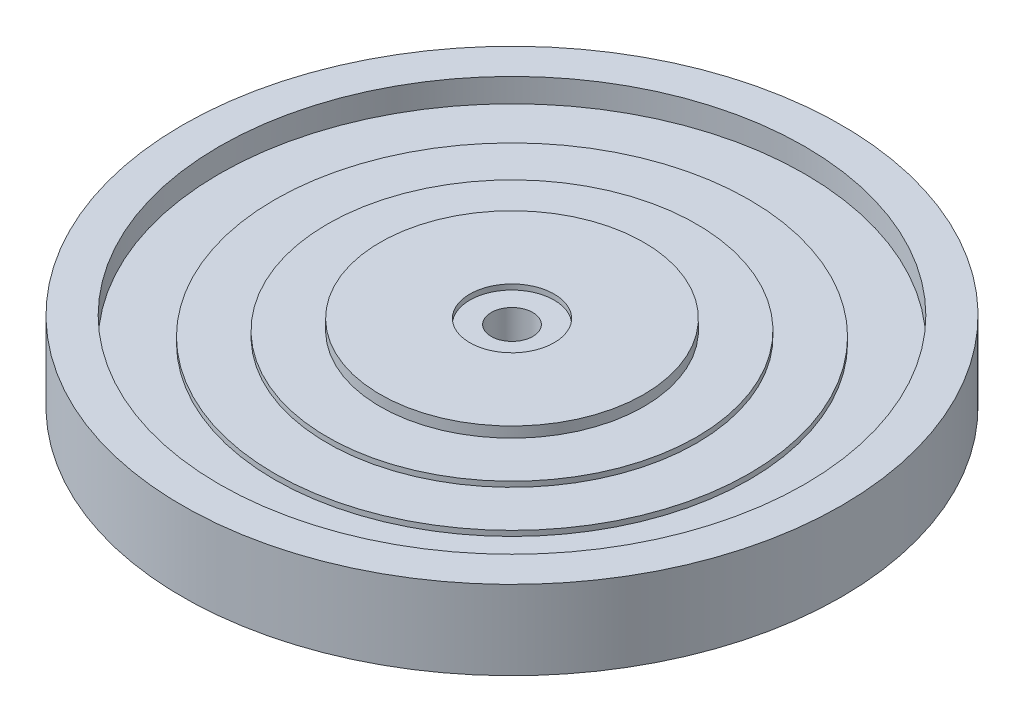
ISO-10303-21;
HEADER;
FILE_DESCRIPTION(('STEP AP214'),'2;1');
FILE_NAME('part.step','',(''),(''),'','','');
FILE_SCHEMA(('AUTOMOTIVE_DESIGN { 1 0 10303 214 1 1 1 1 }'));
ENDSEC;
DATA;
#1=APPLICATION_CONTEXT('core data for automotive mechanical design processes');
#2=APPLICATION_PROTOCOL_DEFINITION('international standard','automotive_design',2000,#1);
#3=PRODUCT_CONTEXT('',#1,'mechanical');
#4=PRODUCT('Part','Part','',(#3));
#5=PRODUCT_RELATED_PRODUCT_CATEGORY('part','',(#4));
#6=PRODUCT_DEFINITION_FORMATION('','',#4);
#7=PRODUCT_DEFINITION_CONTEXT('part definition',#1,'design');
#8=PRODUCT_DEFINITION('design','',#6,#7);
#9=PRODUCT_DEFINITION_SHAPE('','',#8);
#10=(LENGTH_UNIT() NAMED_UNIT(*) SI_UNIT(.MILLI.,.METRE.));
#11=(NAMED_UNIT(*) PLANE_ANGLE_UNIT() SI_UNIT($,.RADIAN.));
#12=(NAMED_UNIT(*) SI_UNIT($,.STERADIAN.) SOLID_ANGLE_UNIT());
#13=UNCERTAINTY_MEASURE_WITH_UNIT(LENGTH_MEASURE(1.E-05),#10,'distance_accuracy_value','');
#14=(GEOMETRIC_REPRESENTATION_CONTEXT(3) GLOBAL_UNCERTAINTY_ASSIGNED_CONTEXT((#13)) GLOBAL_UNIT_ASSIGNED_CONTEXT((#10,
#11,#12)) REPRESENTATION_CONTEXT('',''));
#15=CARTESIAN_POINT('',(0.,0.,0.));
#16=DIRECTION('',(0.,0.,1.));
#17=DIRECTION('',(1.,0.,0.));
#18=AXIS2_PLACEMENT_3D('',#15,#16,#17);
#19=CARTESIAN_POINT('',(0.,-7.62,0.));
#20=DIRECTION('',(0.,-1.,0.));
#21=DIRECTION('',(1.,0.,0.));
#22=AXIS2_PLACEMENT_3D('',#19,#20,#21);
#23=PLANE('',#22);
#24=CARTESIAN_POINT('',(0.,-7.62,0.));
#25=DIRECTION('',(0.,-1.,0.));
#26=DIRECTION('',(1.,0.,0.));
#27=AXIS2_PLACEMENT_3D('',#24,#25,#26);
#28=CIRCLE('',#27,10.16);
#29=CARTESIAN_POINT('',(10.16,-7.62,0.));
#30=VERTEX_POINT('',#29);
#31=EDGE_CURVE('E10',#30,#30,#28,.T.);
#32=ORIENTED_EDGE('',*,*,#31,.T.);
#33=EDGE_LOOP('',(#32));
#34=FACE_BOUND('',#33,.T.);
#35=CARTESIAN_POINT('',(0.,-7.62,0.));
#36=DIRECTION('',(0.,-1.,0.));
#37=DIRECTION('',(1.,0.,0.));
#38=AXIS2_PLACEMENT_3D('',#35,#36,#37);
#39=CIRCLE('',#38,5.00899999999998);
#40=CARTESIAN_POINT('',(5.009,-7.62,0.));
#41=VERTEX_POINT('',#40);
#42=EDGE_CURVE('E114',#41,#41,#39,.T.);
#43=ORIENTED_EDGE('',*,*,#42,.F.);
#44=EDGE_LOOP('',(#43));
#45=FACE_BOUND('',#44,.T.);
#46=ADVANCED_FACE('F38',(#34,#45),#23,.T.);
#47=CARTESIAN_POINT('',(0.,-47.5020865095311,0.));
#48=DIRECTION('',(0.,-1.,0.));
#49=DIRECTION('',(1.,0.,0.));
#50=AXIS2_PLACEMENT_3D('',#47,#48,#49);
#51=CYLINDRICAL_SURFACE('',#50,10.16);
#52=CARTESIAN_POINT('',(0.,-8.89,0.));
#53=DIRECTION('',(0.,-1.,0.));
#54=DIRECTION('',(1.,0.,0.));
#55=AXIS2_PLACEMENT_3D('',#52,#53,#54);
#56=CIRCLE('',#55,10.16);
#57=CARTESIAN_POINT('',(10.16,-8.88999999999999,0.));
#58=VERTEX_POINT('',#57);
#59=EDGE_CURVE('E44',#58,#58,#56,.T.);
#60=ORIENTED_EDGE('',*,*,#59,.T.);
#61=EDGE_LOOP('',(#60));
#62=FACE_BOUND('',#61,.T.);
#63=ORIENTED_EDGE('',*,*,#31,.F.);
#64=EDGE_LOOP('',(#63));
#65=FACE_BOUND('',#64,.T.);
#66=ADVANCED_FACE('F122',(#62,#65),#51,.F.);
#67=CARTESIAN_POINT('',(0.,-8.89,0.));
#68=DIRECTION('',(0.,-1.,0.));
#69=DIRECTION('',(1.,0.,0.));
#70=AXIS2_PLACEMENT_3D('',#67,#68,#69);
#71=PLANE('',#70);
#72=CARTESIAN_POINT('',(0.,-8.89,0.));
#73=DIRECTION('',(0.,-1.,0.));
#74=DIRECTION('',(1.,0.,0.));
#75=AXIS2_PLACEMENT_3D('',#72,#73,#74);
#76=CIRCLE('',#75,31.75);
#77=CARTESIAN_POINT('',(31.75,-8.89,0.));
#78=VERTEX_POINT('',#77);
#79=EDGE_CURVE('E48',#78,#78,#76,.T.);
#80=ORIENTED_EDGE('',*,*,#79,.T.);
#81=EDGE_LOOP('',(#80));
#82=FACE_BOUND('',#81,.T.);
#83=ORIENTED_EDGE('',*,*,#59,.F.);
#84=EDGE_LOOP('',(#83));
#85=FACE_BOUND('',#84,.T.);
#86=ADVANCED_FACE('F126',(#82,#85),#71,.T.);
#87=CARTESIAN_POINT('',(0.,-47.5020865095311,0.));
#88=DIRECTION('',(0.,-1.,0.));
#89=DIRECTION('',(1.,0.,0.));
#90=AXIS2_PLACEMENT_3D('',#87,#88,#89);
#91=CYLINDRICAL_SURFACE('',#90,31.75);
#92=CARTESIAN_POINT('',(0.,-6.35000000000001,0.));
#93=DIRECTION('',(0.,-1.,0.));
#94=DIRECTION('',(1.,0.,0.));
#95=AXIS2_PLACEMENT_3D('',#92,#93,#94);
#96=CIRCLE('',#95,31.75);
#97=CARTESIAN_POINT('',(31.75,-6.35,0.));
#98=VERTEX_POINT('',#97);
#99=EDGE_CURVE('E52',#98,#98,#96,.T.);
#100=ORIENTED_EDGE('',*,*,#99,.T.);
#101=EDGE_LOOP('',(#100));
#102=FACE_BOUND('',#101,.T.);
#103=ORIENTED_EDGE('',*,*,#79,.F.);
#104=EDGE_LOOP('',(#103));
#105=FACE_BOUND('',#104,.T.);
#106=ADVANCED_FACE('F130',(#102,#105),#91,.T.);
#107=CARTESIAN_POINT('',(0.,-6.35000000000001,0.));
#108=DIRECTION('',(0.,-1.,0.));
#109=DIRECTION('',(1.,0.,0.));
#110=AXIS2_PLACEMENT_3D('',#107,#108,#109);
#111=PLANE('',#110);
#112=CARTESIAN_POINT('',(0.,-6.35000000000001,0.));
#113=DIRECTION('',(0.,-1.,0.));
#114=DIRECTION('',(1.,0.,0.));
#115=AXIS2_PLACEMENT_3D('',#112,#113,#114);
#116=CIRCLE('',#115,44.45);
#117=CARTESIAN_POINT('',(44.45,-6.35,0.));
#118=VERTEX_POINT('',#117);
#119=EDGE_CURVE('E57',#118,#118,#116,.T.);
#120=ORIENTED_EDGE('',*,*,#119,.T.);
#121=EDGE_LOOP('',(#120));
#122=FACE_BOUND('',#121,.T.);
#123=ORIENTED_EDGE('',*,*,#99,.F.);
#124=EDGE_LOOP('',(#123));
#125=FACE_BOUND('',#124,.T.);
#126=ADVANCED_FACE('F137',(#122,#125),#111,.T.);
#127=CARTESIAN_POINT('',(0.,-47.5020865095311,0.));
#128=DIRECTION('',(0.,-1.,0.));
#129=DIRECTION('',(1.,0.,0.));
#130=AXIS2_PLACEMENT_3D('',#127,#128,#129);
#131=CYLINDRICAL_SURFACE('',#130,44.45);
#132=CARTESIAN_POINT('',(0.,-5.08000000000001,0.));
#133=DIRECTION('',(0.,-1.,0.));
#134=DIRECTION('',(1.,0.,0.));
#135=AXIS2_PLACEMENT_3D('',#132,#133,#134);
#136=CIRCLE('',#135,44.45);
#137=CARTESIAN_POINT('',(44.45,-5.08,0.));
#138=VERTEX_POINT('',#137);
#139=EDGE_CURVE('E60',#138,#138,#136,.T.);
#140=ORIENTED_EDGE('',*,*,#139,.T.);
#141=EDGE_LOOP('',(#140));
#142=FACE_BOUND('',#141,.T.);
#143=ORIENTED_EDGE('',*,*,#119,.F.);
#144=EDGE_LOOP('',(#143));
#145=FACE_BOUND('',#144,.T.);
#146=ADVANCED_FACE('F141',(#142,#145),#131,.T.);
#147=CARTESIAN_POINT('',(0.,-5.08000000000001,0.));
#148=DIRECTION('',(0.,-1.,0.));
#149=DIRECTION('',(1.,0.,0.));
#150=AXIS2_PLACEMENT_3D('',#147,#148,#149);
#151=PLANE('',#150);
#152=CARTESIAN_POINT('',(0.,-5.08000000000002,0.));
#153=DIRECTION('',(0.,-1.,0.));
#154=DIRECTION('',(1.,0.,0.));
#155=AXIS2_PLACEMENT_3D('',#152,#153,#154);
#156=CIRCLE('',#155,57.15);
#157=CARTESIAN_POINT('',(57.15,-5.08,0.));
#158=VERTEX_POINT('',#157);
#159=EDGE_CURVE('E63',#158,#158,#156,.T.);
#160=ORIENTED_EDGE('',*,*,#159,.T.);
#161=EDGE_LOOP('',(#160));
#162=FACE_BOUND('',#161,.T.);
#163=ORIENTED_EDGE('',*,*,#139,.F.);
#164=EDGE_LOOP('',(#163));
#165=FACE_BOUND('',#164,.T.);
#166=ADVANCED_FACE('F145',(#162,#165),#151,.T.);
#167=CARTESIAN_POINT('',(0.,-47.5020865095311,0.));
#168=DIRECTION('',(0.,-1.,0.));
#169=DIRECTION('',(1.,0.,0.));
#170=AXIS2_PLACEMENT_3D('',#167,#168,#169);
#171=CYLINDRICAL_SURFACE('',#170,57.15);
#172=CARTESIAN_POINT('',(0.,-3.81000000000001,0.));
#173=DIRECTION('',(0.,-1.,0.));
#174=DIRECTION('',(1.,0.,0.));
#175=AXIS2_PLACEMENT_3D('',#172,#173,#174);
#176=CIRCLE('',#175,57.15);
#177=CARTESIAN_POINT('',(57.15,-3.81,0.));
#178=VERTEX_POINT('',#177);
#179=EDGE_CURVE('E66',#178,#178,#176,.T.);
#180=ORIENTED_EDGE('',*,*,#179,.T.);
#181=EDGE_LOOP('',(#180));
#182=FACE_BOUND('',#181,.T.);
#183=ORIENTED_EDGE('',*,*,#159,.F.);
#184=EDGE_LOOP('',(#183));
#185=FACE_BOUND('',#184,.T.);
#186=ADVANCED_FACE('F149',(#182,#185),#171,.T.);
#187=CARTESIAN_POINT('',(0.,-3.81000000000001,0.));
#188=DIRECTION('',(0.,-1.,0.));
#189=DIRECTION('',(1.,0.,0.));
#190=AXIS2_PLACEMENT_3D('',#187,#188,#189);
#191=PLANE('',#190);
#192=CARTESIAN_POINT('',(0.,-3.81000000000001,0.));
#193=DIRECTION('',(0.,-1.,0.));
#194=DIRECTION('',(1.,0.,0.));
#195=AXIS2_PLACEMENT_3D('',#192,#193,#194);
#196=CIRCLE('',#195,70.485);
#197=CARTESIAN_POINT('',(70.485,-3.81,0.));
#198=VERTEX_POINT('',#197);
#199=EDGE_CURVE('E69',#198,#198,#196,.T.);
#200=ORIENTED_EDGE('',*,*,#199,.T.);
#201=EDGE_LOOP('',(#200));
#202=FACE_BOUND('',#201,.T.);
#203=ORIENTED_EDGE('',*,*,#179,.F.);
#204=EDGE_LOOP('',(#203));
#205=FACE_BOUND('',#204,.T.);
#206=ADVANCED_FACE('F153',(#202,#205),#191,.T.);
#207=CARTESIAN_POINT('',(0.,-47.5020865095311,0.));
#208=DIRECTION('',(0.,-1.,0.));
#209=DIRECTION('',(1.,0.,0.));
#210=AXIS2_PLACEMENT_3D('',#207,#208,#209);
#211=CYLINDRICAL_SURFACE('',#210,70.485);
#212=CARTESIAN_POINT('',(0.,-9.52500000000001,0.));
#213=DIRECTION('',(0.,-1.,0.));
#214=DIRECTION('',(1.,0.,0.));
#215=AXIS2_PLACEMENT_3D('',#212,#213,#214);
#216=CIRCLE('',#215,70.485);
#217=CARTESIAN_POINT('',(70.485,-9.525,0.));
#218=VERTEX_POINT('',#217);
#219=EDGE_CURVE('E72',#218,#218,#216,.T.);
#220=ORIENTED_EDGE('',*,*,#219,.T.);
#221=EDGE_LOOP('',(#220));
#222=FACE_BOUND('',#221,.T.);
#223=ORIENTED_EDGE('',*,*,#199,.F.);
#224=EDGE_LOOP('',(#223));
#225=FACE_BOUND('',#224,.T.);
#226=ADVANCED_FACE('F157',(#222,#225),#211,.F.);
#227=CARTESIAN_POINT('',(0.,-9.52500000000001,0.));
#228=DIRECTION('',(0.,-1.,0.));
#229=DIRECTION('',(1.,0.,0.));
#230=AXIS2_PLACEMENT_3D('',#227,#228,#229);
#231=PLANE('',#230);
#232=CARTESIAN_POINT('',(0.,-9.52500000000001,0.));
#233=DIRECTION('',(0.,-1.,0.));
#234=DIRECTION('',(1.,0.,0.));
#235=AXIS2_PLACEMENT_3D('',#232,#233,#234);
#236=CIRCLE('',#235,79.375);
#237=CARTESIAN_POINT('',(79.375,-9.525,0.));
#238=VERTEX_POINT('',#237);
#239=EDGE_CURVE('E75',#238,#238,#236,.T.);
#240=ORIENTED_EDGE('',*,*,#239,.T.);
#241=EDGE_LOOP('',(#240));
#242=FACE_BOUND('',#241,.T.);
#243=ORIENTED_EDGE('',*,*,#219,.F.);
#244=EDGE_LOOP('',(#243));
#245=FACE_BOUND('',#244,.T.);
#246=ADVANCED_FACE('F161',(#242,#245),#231,.T.);
#247=CARTESIAN_POINT('',(0.,-47.5020865095311,0.));
#248=DIRECTION('',(0.,-1.,0.));
#249=DIRECTION('',(1.,0.,0.));
#250=AXIS2_PLACEMENT_3D('',#247,#248,#249);
#251=CYLINDRICAL_SURFACE('',#250,79.375);
#252=CARTESIAN_POINT('',(0.,9.52499999999998,0.));
#253=DIRECTION('',(0.,-1.,0.));
#254=DIRECTION('',(1.,0.,0.));
#255=AXIS2_PLACEMENT_3D('',#252,#253,#254);
#256=CIRCLE('',#255,79.375);
#257=CARTESIAN_POINT('',(79.375,9.525,0.));
#258=VERTEX_POINT('',#257);
#259=EDGE_CURVE('E78',#258,#258,#256,.T.);
#260=ORIENTED_EDGE('',*,*,#259,.T.);
#261=EDGE_LOOP('',(#260));
#262=FACE_BOUND('',#261,.T.);
#263=ORIENTED_EDGE('',*,*,#239,.F.);
#264=EDGE_LOOP('',(#263));
#265=FACE_BOUND('',#264,.T.);
#266=ADVANCED_FACE('F165',(#262,#265),#251,.T.);
#267=CARTESIAN_POINT('',(0.,9.52499999999999,0.));
#268=DIRECTION('',(0.,1.,0.));
#269=DIRECTION('',(-1.,0.,0.));
#270=AXIS2_PLACEMENT_3D('',#267,#268,#269);
#271=PLANE('',#270);
#272=CARTESIAN_POINT('',(0.,9.52499999999998,0.));
#273=DIRECTION('',(0.,-1.,0.));
#274=DIRECTION('',(1.,0.,0.));
#275=AXIS2_PLACEMENT_3D('',#272,#273,#274);
#276=CIRCLE('',#275,70.485);
#277=CARTESIAN_POINT('',(70.485,9.525,0.));
#278=VERTEX_POINT('',#277);
#279=EDGE_CURVE('E81',#278,#278,#276,.T.);
#280=ORIENTED_EDGE('',*,*,#279,.T.);
#281=EDGE_LOOP('',(#280));
#282=FACE_BOUND('',#281,.T.);
#283=ORIENTED_EDGE('',*,*,#259,.F.);
#284=EDGE_LOOP('',(#283));
#285=FACE_BOUND('',#284,.T.);
#286=ADVANCED_FACE('F169',(#282,#285),#271,.T.);
#287=CARTESIAN_POINT('',(0.,-47.5020865095311,0.));
#288=DIRECTION('',(0.,-1.,0.));
#289=DIRECTION('',(1.,0.,0.));
#290=AXIS2_PLACEMENT_3D('',#287,#288,#289);
#291=CYLINDRICAL_SURFACE('',#290,70.485);
#292=CARTESIAN_POINT('',(0.,3.80999999999999,0.));
#293=DIRECTION('',(0.,-1.,0.));
#294=DIRECTION('',(1.,0.,0.));
#295=AXIS2_PLACEMENT_3D('',#292,#293,#294);
#296=CIRCLE('',#295,70.485);
#297=CARTESIAN_POINT('',(70.485,3.81,0.));
#298=VERTEX_POINT('',#297);
#299=EDGE_CURVE('E84',#298,#298,#296,.T.);
#300=ORIENTED_EDGE('',*,*,#299,.T.);
#301=EDGE_LOOP('',(#300));
#302=FACE_BOUND('',#301,.T.);
#303=ORIENTED_EDGE('',*,*,#279,.F.);
#304=EDGE_LOOP('',(#303));
#305=FACE_BOUND('',#304,.T.);
#306=ADVANCED_FACE('F173',(#302,#305),#291,.F.);
#307=CARTESIAN_POINT('',(0.,3.80999999999999,0.));
#308=DIRECTION('',(0.,-1.,0.));
#309=DIRECTION('',(1.,0.,0.));
#310=AXIS2_PLACEMENT_3D('',#307,#308,#309);
#311=PLANE('',#310);
#312=ORIENTED_EDGE('',*,*,#299,.F.);
#313=EDGE_LOOP('',(#312));
#314=FACE_BOUND('',#313,.T.);
#315=CARTESIAN_POINT('',(0.,3.80999999999999,0.));
#316=DIRECTION('',(0.,-1.,0.));
#317=DIRECTION('',(1.,0.,0.));
#318=AXIS2_PLACEMENT_3D('',#315,#316,#317);
#319=CIRCLE('',#318,57.15);
#320=CARTESIAN_POINT('',(57.15,3.81,0.));
#321=VERTEX_POINT('',#320);
#322=EDGE_CURVE('E87',#321,#321,#319,.T.);
#323=ORIENTED_EDGE('',*,*,#322,.T.);
#324=EDGE_LOOP('',(#323));
#325=FACE_BOUND('',#324,.T.);
#326=ADVANCED_FACE('F177',(#314,#325),#311,.F.);
#327=CARTESIAN_POINT('',(0.,-47.5020865095311,0.));
#328=DIRECTION('',(0.,-1.,0.));
#329=DIRECTION('',(1.,0.,0.));
#330=AXIS2_PLACEMENT_3D('',#327,#328,#329);
#331=CYLINDRICAL_SURFACE('',#330,57.15);
#332=ORIENTED_EDGE('',*,*,#322,.F.);
#333=EDGE_LOOP('',(#332));
#334=FACE_BOUND('',#333,.T.);
#335=CARTESIAN_POINT('',(0.,5.07999999999999,0.));
#336=DIRECTION('',(0.,-1.,0.));
#337=DIRECTION('',(1.,0.,0.));
#338=AXIS2_PLACEMENT_3D('',#335,#336,#337);
#339=CIRCLE('',#338,57.15);
#340=CARTESIAN_POINT('',(57.15,5.08,0.));
#341=VERTEX_POINT('',#340);
#342=EDGE_CURVE('E90',#341,#341,#339,.T.);
#343=ORIENTED_EDGE('',*,*,#342,.T.);
#344=EDGE_LOOP('',(#343));
#345=FACE_BOUND('',#344,.T.);
#346=ADVANCED_FACE('F181',(#334,#345),#331,.T.);
#347=CARTESIAN_POINT('',(0.,5.07999999999999,0.));
#348=DIRECTION('',(0.,-1.,0.));
#349=DIRECTION('',(1.,0.,0.));
#350=AXIS2_PLACEMENT_3D('',#347,#348,#349);
#351=PLANE('',#350);
#352=ORIENTED_EDGE('',*,*,#342,.F.);
#353=EDGE_LOOP('',(#352));
#354=FACE_BOUND('',#353,.T.);
#355=CARTESIAN_POINT('',(0.,5.07999999999999,0.));
#356=DIRECTION('',(0.,-1.,0.));
#357=DIRECTION('',(1.,0.,0.));
#358=AXIS2_PLACEMENT_3D('',#355,#356,#357);
#359=CIRCLE('',#358,44.45);
#360=CARTESIAN_POINT('',(44.45,5.08,0.));
#361=VERTEX_POINT('',#360);
#362=EDGE_CURVE('E93',#361,#361,#359,.T.);
#363=ORIENTED_EDGE('',*,*,#362,.T.);
#364=EDGE_LOOP('',(#363));
#365=FACE_BOUND('',#364,.T.);
#366=ADVANCED_FACE('F185',(#354,#365),#351,.F.);
#367=CARTESIAN_POINT('',(0.,-47.5020865095311,0.));
#368=DIRECTION('',(0.,-1.,0.));
#369=DIRECTION('',(1.,0.,0.));
#370=AXIS2_PLACEMENT_3D('',#367,#368,#369);
#371=CYLINDRICAL_SURFACE('',#370,44.45);
#372=ORIENTED_EDGE('',*,*,#362,.F.);
#373=EDGE_LOOP('',(#372));
#374=FACE_BOUND('',#373,.T.);
#375=CARTESIAN_POINT('',(0.,6.34999999999999,0.));
#376=DIRECTION('',(0.,-1.,0.));
#377=DIRECTION('',(1.,0.,0.));
#378=AXIS2_PLACEMENT_3D('',#375,#376,#377);
#379=CIRCLE('',#378,44.45);
#380=CARTESIAN_POINT('',(44.45,6.35,0.));
#381=VERTEX_POINT('',#380);
#382=EDGE_CURVE('E96',#381,#381,#379,.T.);
#383=ORIENTED_EDGE('',*,*,#382,.T.);
#384=EDGE_LOOP('',(#383));
#385=FACE_BOUND('',#384,.T.);
#386=ADVANCED_FACE('F189',(#374,#385),#371,.T.);
#387=CARTESIAN_POINT('',(0.,6.34999999999999,0.));
#388=DIRECTION('',(0.,-1.,0.));
#389=DIRECTION('',(1.,0.,0.));
#390=AXIS2_PLACEMENT_3D('',#387,#388,#389);
#391=PLANE('',#390);
#392=ORIENTED_EDGE('',*,*,#382,.F.);
#393=EDGE_LOOP('',(#392));
#394=FACE_BOUND('',#393,.T.);
#395=CARTESIAN_POINT('',(0.,6.34999999999999,0.));
#396=DIRECTION('',(0.,-1.,0.));
#397=DIRECTION('',(1.,0.,0.));
#398=AXIS2_PLACEMENT_3D('',#395,#396,#397);
#399=CIRCLE('',#398,31.75);
#400=CARTESIAN_POINT('',(31.75,6.35,0.));
#401=VERTEX_POINT('',#400);
#402=EDGE_CURVE('E99',#401,#401,#399,.T.);
#403=ORIENTED_EDGE('',*,*,#402,.T.);
#404=EDGE_LOOP('',(#403));
#405=FACE_BOUND('',#404,.T.);
#406=ADVANCED_FACE('F193',(#394,#405),#391,.F.);
#407=CARTESIAN_POINT('',(0.,-47.5020865095311,0.));
#408=DIRECTION('',(0.,-1.,0.));
#409=DIRECTION('',(1.,0.,0.));
#410=AXIS2_PLACEMENT_3D('',#407,#408,#409);
#411=CYLINDRICAL_SURFACE('',#410,31.75);
#412=ORIENTED_EDGE('',*,*,#402,.F.);
#413=EDGE_LOOP('',(#412));
#414=FACE_BOUND('',#413,.T.);
#415=CARTESIAN_POINT('',(0.,8.88999999999999,0.));
#416=DIRECTION('',(0.,-1.,0.));
#417=DIRECTION('',(1.,0.,0.));
#418=AXIS2_PLACEMENT_3D('',#415,#416,#417);
#419=CIRCLE('',#418,31.75);
#420=CARTESIAN_POINT('',(31.75,8.88999999999999,0.));
#421=VERTEX_POINT('',#420);
#422=EDGE_CURVE('E102',#421,#421,#419,.T.);
#423=ORIENTED_EDGE('',*,*,#422,.T.);
#424=EDGE_LOOP('',(#423));
#425=FACE_BOUND('',#424,.T.);
#426=ADVANCED_FACE('F197',(#414,#425),#411,.T.);
#427=CARTESIAN_POINT('',(0.,8.89,0.));
#428=DIRECTION('',(0.,-1.,0.));
#429=DIRECTION('',(1.,0.,0.));
#430=AXIS2_PLACEMENT_3D('',#427,#428,#429);
#431=PLANE('',#430);
#432=ORIENTED_EDGE('',*,*,#422,.F.);
#433=EDGE_LOOP('',(#432));
#434=FACE_BOUND('',#433,.T.);
#435=CARTESIAN_POINT('',(0.,8.89,0.));
#436=DIRECTION('',(0.,-1.,0.));
#437=DIRECTION('',(1.,0.,0.));
#438=AXIS2_PLACEMENT_3D('',#435,#436,#437);
#439=CIRCLE('',#438,10.16);
#440=CARTESIAN_POINT('',(10.16,8.89,0.));
#441=VERTEX_POINT('',#440);
#442=EDGE_CURVE('E105',#441,#441,#439,.T.);
#443=ORIENTED_EDGE('',*,*,#442,.T.);
#444=EDGE_LOOP('',(#443));
#445=FACE_BOUND('',#444,.T.);
#446=ADVANCED_FACE('F201',(#434,#445),#431,.F.);
#447=CARTESIAN_POINT('',(0.,-47.5020865095311,0.));
#448=DIRECTION('',(0.,-1.,0.));
#449=DIRECTION('',(1.,0.,0.));
#450=AXIS2_PLACEMENT_3D('',#447,#448,#449);
#451=CYLINDRICAL_SURFACE('',#450,10.16);
#452=CARTESIAN_POINT('',(0.,7.62,0.));
#453=DIRECTION('',(0.,-1.,0.));
#454=DIRECTION('',(1.,0.,0.));
#455=AXIS2_PLACEMENT_3D('',#452,#453,#454);
#456=CIRCLE('',#455,10.16);
#457=CARTESIAN_POINT('',(10.16,7.62,0.));
#458=VERTEX_POINT('',#457);
#459=EDGE_CURVE('E108',#458,#458,#456,.T.);
#460=ORIENTED_EDGE('',*,*,#459,.T.);
#461=EDGE_LOOP('',(#460));
#462=FACE_BOUND('',#461,.T.);
#463=ORIENTED_EDGE('',*,*,#442,.F.);
#464=EDGE_LOOP('',(#463));
#465=FACE_BOUND('',#464,.T.);
#466=ADVANCED_FACE('F205',(#462,#465),#451,.F.);
#467=CARTESIAN_POINT('',(0.,7.62,0.));
#468=DIRECTION('',(0.,-1.,0.));
#469=DIRECTION('',(1.,0.,0.));
#470=AXIS2_PLACEMENT_3D('',#467,#468,#469);
#471=PLANE('',#470);
#472=ORIENTED_EDGE('',*,*,#459,.F.);
#473=EDGE_LOOP('',(#472));
#474=FACE_BOUND('',#473,.T.);
#475=CARTESIAN_POINT('',(0.,7.62,0.));
#476=DIRECTION('',(0.,-1.,0.));
#477=DIRECTION('',(1.,0.,0.));
#478=AXIS2_PLACEMENT_3D('',#475,#476,#477);
#479=CIRCLE('',#478,5.00899999999999);
#480=CARTESIAN_POINT('',(5.009,7.62,0.));
#481=VERTEX_POINT('',#480);
#482=EDGE_CURVE('E111',#481,#481,#479,.T.);
#483=ORIENTED_EDGE('',*,*,#482,.T.);
#484=EDGE_LOOP('',(#483));
#485=FACE_BOUND('',#484,.T.);
#486=ADVANCED_FACE('F209',(#474,#485),#471,.F.);
#487=CARTESIAN_POINT('',(0.,-47.5020865095311,0.));
#488=DIRECTION('',(0.,-1.,0.));
#489=DIRECTION('',(1.,0.,0.));
#490=AXIS2_PLACEMENT_3D('',#487,#488,#489);
#491=CYLINDRICAL_SURFACE('',#490,5.00899999999998);
#492=ORIENTED_EDGE('',*,*,#42,.T.);
#493=EDGE_LOOP('',(#492));
#494=FACE_BOUND('',#493,.T.);
#495=ORIENTED_EDGE('',*,*,#482,.F.);
#496=EDGE_LOOP('',(#495));
#497=FACE_BOUND('',#496,.T.);
#498=ADVANCED_FACE('F118',(#494,#497),#491,.F.);
#499=CLOSED_SHELL('',(#46,#66,#86,#106,#126,#146,#166,#186,#206,#226,#246,#266,#286,#306,#326,
#346,#366,#386,#406,#426,#446,#466,#486,#498));
#500=MANIFOLD_SOLID_BREP('B2',#499);
#501=ADVANCED_BREP_SHAPE_REPRESENTATION('',(#18,#500),#14);
#502=SHAPE_DEFINITION_REPRESENTATION(#9,#501);
ENDSEC;
END-ISO-10303-21;
